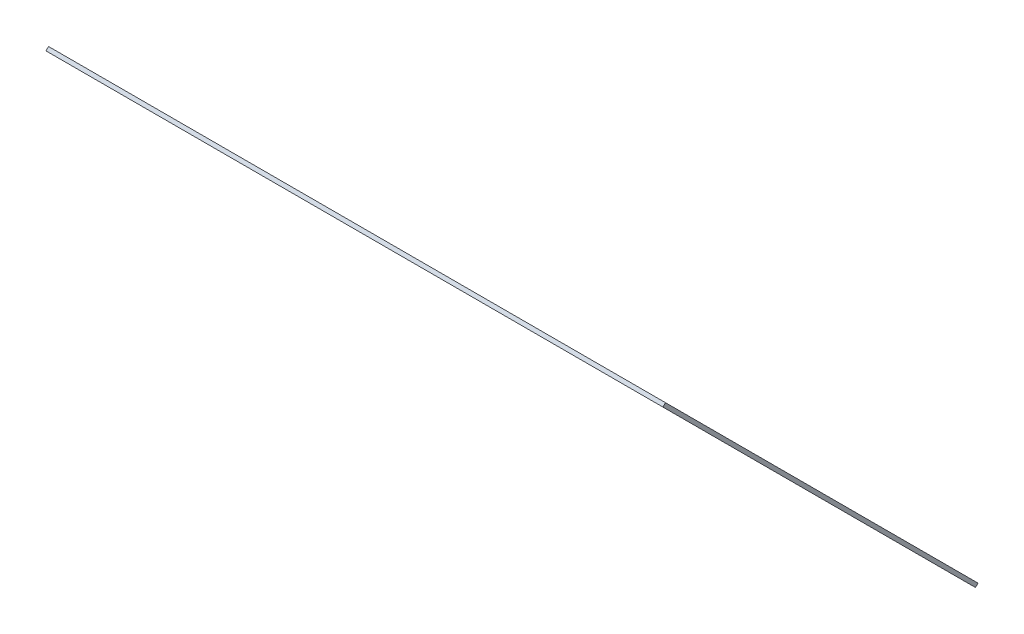
ISO-10303-21;
HEADER;
FILE_DESCRIPTION(('STEP AP214'),'2;1');
FILE_NAME('part.step','',(''),(''),'','','');
FILE_SCHEMA(('AUTOMOTIVE_DESIGN { 1 0 10303 214 1 1 1 1 }'));
ENDSEC;
DATA;
#1=APPLICATION_CONTEXT('core data for automotive mechanical design processes');
#2=APPLICATION_PROTOCOL_DEFINITION('international standard','automotive_design',2000,#1);
#3=PRODUCT_CONTEXT('',#1,'mechanical');
#4=PRODUCT('Part','Part','',(#3));
#5=PRODUCT_RELATED_PRODUCT_CATEGORY('part','',(#4));
#6=PRODUCT_DEFINITION_FORMATION('','',#4);
#7=PRODUCT_DEFINITION_CONTEXT('part definition',#1,'design');
#8=PRODUCT_DEFINITION('design','',#6,#7);
#9=PRODUCT_DEFINITION_SHAPE('','',#8);
#10=(LENGTH_UNIT() NAMED_UNIT(*) SI_UNIT(.MILLI.,.METRE.));
#11=(NAMED_UNIT(*) PLANE_ANGLE_UNIT() SI_UNIT($,.RADIAN.));
#12=(NAMED_UNIT(*) SI_UNIT($,.STERADIAN.) SOLID_ANGLE_UNIT());
#13=UNCERTAINTY_MEASURE_WITH_UNIT(LENGTH_MEASURE(1.E-05),#10,'distance_accuracy_value','');
#14=(GEOMETRIC_REPRESENTATION_CONTEXT(3) GLOBAL_UNCERTAINTY_ASSIGNED_CONTEXT((#13)) GLOBAL_UNIT_ASSIGNED_CONTEXT((#10,
#11,#12)) REPRESENTATION_CONTEXT('',''));
#15=CARTESIAN_POINT('',(0.,0.,0.));
#16=DIRECTION('',(0.,0.,1.));
#17=DIRECTION('',(1.,0.,0.));
#18=AXIS2_PLACEMENT_3D('',#15,#16,#17);
#19=CARTESIAN_POINT('',(1.49999999999996,262.414213562373,35.5857864376269));
#20=DIRECTION('',(1.,0.,0.));
#21=DIRECTION('',(0.,0.,-1.));
#22=AXIS2_PLACEMENT_3D('',#19,#20,#21);
#23=PLANE('',#22);
#24=DIRECTION('',(0.,0.707106781186549,0.707106781186547));
#25=VECTOR('',#24,1.);
#26=CARTESIAN_POINT('',(1.49999999999996,261.,37.));
#27=LINE('',#26,#25);
#28=CARTESIAN_POINT('',(1.49999999999996,261.,37.));
#29=VERTEX_POINT('',#28);
#30=CARTESIAN_POINT('',(1.49999999999996,434.241161390704,210.241161390704));
#31=VERTEX_POINT('',#30);
#32=EDGE_CURVE('E100',#29,#31,#27,.T.);
#33=ORIENTED_EDGE('',*,*,#32,.F.);
#34=DIRECTION('',(0.,-0.707106781186546,0.707106781186549));
#35=VECTOR('',#34,1.);
#36=CARTESIAN_POINT('',(1.49999999999996,262.414213562373,35.5857864376269));
#37=LINE('',#36,#35);
#38=CARTESIAN_POINT('',(1.49999999999996,262.414213562373,35.5857864376269));
#39=VERTEX_POINT('',#38);
#40=EDGE_CURVE('E11',#39,#29,#37,.T.);
#41=ORIENTED_EDGE('',*,*,#40,.F.);
#42=DIRECTION('',(0.,0.707106781186549,0.707106781186547));
#43=VECTOR('',#42,1.);
#44=CARTESIAN_POINT('',(1.49999999999996,262.414213562373,35.5857864376269));
#45=LINE('',#44,#43);
#46=CARTESIAN_POINT('',(1.49999999999996,435.655374953078,208.826947828331));
#47=VERTEX_POINT('',#46);
#48=EDGE_CURVE('E94',#39,#47,#45,.T.);
#49=ORIENTED_EDGE('',*,*,#48,.T.);
#50=DIRECTION('',(0.,-0.707106781186546,0.707106781186549));
#51=VECTOR('',#50,1.);
#52=CARTESIAN_POINT('',(1.49999999999996,435.655374953078,208.826947828331));
#53=LINE('',#52,#51);
#54=EDGE_CURVE('E39',#47,#31,#53,.T.);
#55=ORIENTED_EDGE('',*,*,#54,.T.);
#56=EDGE_LOOP('',(#33,#41,#49,#55));
#57=FACE_BOUND('',#56,.T.);
#58=ADVANCED_FACE('F36',(#57),#23,.T.);
#59=CARTESIAN_POINT('',(-48.5,262.414213562373,35.5857864376269));
#60=DIRECTION('',(0.,-0.707106781186549,-0.707106781186546));
#61=DIRECTION('',(0.,0.707106781186546,-0.707106781186549));
#62=AXIS2_PLACEMENT_3D('',#59,#60,#61);
#63=PLANE('',#62);
#64=DIRECTION('',(1.,0.,0.));
#65=VECTOR('',#64,1.);
#66=CARTESIAN_POINT('',(-48.5,261.,37.));
#67=LINE('',#66,#65);
#68=CARTESIAN_POINT('',(-48.5,261.,37.));
#69=VERTEX_POINT('',#68);
#70=EDGE_CURVE('E96',#69,#29,#67,.T.);
#71=ORIENTED_EDGE('',*,*,#70,.F.);
#72=DIRECTION('',(0.,-0.707106781186546,0.707106781186549));
#73=VECTOR('',#72,1.);
#74=CARTESIAN_POINT('',(-48.5,262.414213562373,35.5857864376269));
#75=LINE('',#74,#73);
#76=CARTESIAN_POINT('',(-48.5,262.414213562373,35.5857864376269));
#77=VERTEX_POINT('',#76);
#78=EDGE_CURVE('E45',#77,#69,#75,.T.);
#79=ORIENTED_EDGE('',*,*,#78,.F.);
#80=DIRECTION('',(1.,0.,0.));
#81=VECTOR('',#80,1.);
#82=CARTESIAN_POINT('',(-48.5,262.414213562373,35.5857864376269));
#83=LINE('',#82,#81);
#84=EDGE_CURVE('E91',#77,#39,#83,.T.);
#85=ORIENTED_EDGE('',*,*,#84,.T.);
#86=ORIENTED_EDGE('',*,*,#40,.T.);
#87=EDGE_LOOP('',(#71,#79,#85,#86));
#88=FACE_BOUND('',#87,.T.);
#89=ADVANCED_FACE('F110',(#88),#63,.T.);
#90=CARTESIAN_POINT('',(-340.479630185585,435.655374953078,208.826947828331));
#91=DIRECTION('',(-0.642787609686535,-0.541675220419706,-0.541675220419704));
#92=DIRECTION('',(0.644400477571777,-0.764688187763657,0.));
#93=AXIS2_PLACEMENT_3D('',#90,#91,#92);
#94=PLANE('',#93);
#95=DIRECTION('',(0.766044443118982,-0.454519477672041,-0.454519477672039));
#96=VECTOR('',#95,1.);
#97=CARTESIAN_POINT('',(-340.479630185585,434.241161390705,210.241161390704));
#98=LINE('',#97,#96);
#99=CARTESIAN_POINT('',(-340.479630185585,434.241161390705,210.241161390704));
#100=VERTEX_POINT('',#99);
#101=EDGE_CURVE('E86',#100,#69,#98,.T.);
#102=ORIENTED_EDGE('',*,*,#101,.F.);
#103=DIRECTION('',(0.,-0.707106781186546,0.707106781186549));
#104=VECTOR('',#103,1.);
#105=CARTESIAN_POINT('',(-340.479630185585,435.655374953078,208.826947828331));
#106=LINE('',#105,#104);
#107=CARTESIAN_POINT('',(-340.479630185585,435.655374953078,208.826947828331));
#108=VERTEX_POINT('',#107);
#109=EDGE_CURVE('E81',#108,#100,#106,.T.);
#110=ORIENTED_EDGE('',*,*,#109,.F.);
#111=DIRECTION('',(0.766044443118982,-0.454519477672041,-0.454519477672039));
#112=VECTOR('',#111,1.);
#113=CARTESIAN_POINT('',(-340.479630185585,435.655374953078,208.826947828331));
#114=LINE('',#113,#112);
#115=EDGE_CURVE('E84',#108,#77,#114,.T.);
#116=ORIENTED_EDGE('',*,*,#115,.T.);
#117=ORIENTED_EDGE('',*,*,#78,.T.);
#118=EDGE_LOOP('',(#102,#110,#116,#117));
#119=FACE_BOUND('',#118,.T.);
#120=ADVANCED_FACE('F83',(#119),#94,.T.);
#121=CARTESIAN_POINT('',(1.49999999999996,435.655374953078,208.826947828331));
#122=DIRECTION('',(0.,0.707106781186549,0.707106781186546));
#123=DIRECTION('',(0.,-0.707106781186546,0.707106781186549));
#124=AXIS2_PLACEMENT_3D('',#121,#122,#123);
#125=PLANE('',#124);
#126=DIRECTION('',(-1.,0.,0.));
#127=VECTOR('',#126,1.);
#128=CARTESIAN_POINT('',(1.49999999999996,434.241161390704,210.241161390704));
#129=LINE('',#128,#127);
#130=EDGE_CURVE('E103',#31,#100,#129,.T.);
#131=ORIENTED_EDGE('',*,*,#130,.F.);
#132=ORIENTED_EDGE('',*,*,#54,.F.);
#133=DIRECTION('',(-1.,0.,0.));
#134=VECTOR('',#133,1.);
#135=CARTESIAN_POINT('',(1.49999999999996,435.655374953078,208.826947828331));
#136=LINE('',#135,#134);
#137=EDGE_CURVE('E90',#47,#108,#136,.T.);
#138=ORIENTED_EDGE('',*,*,#137,.T.);
#139=ORIENTED_EDGE('',*,*,#109,.T.);
#140=EDGE_LOOP('',(#131,#132,#138,#139));
#141=FACE_BOUND('',#140,.T.);
#142=ADVANCED_FACE('F93',(#141),#125,.T.);
#143=CARTESIAN_POINT('',(0.,113.414213562373,-113.414213562373));
#144=DIRECTION('',(0.,-0.707106781186546,0.707106781186549));
#145=DIRECTION('',(0.,-0.707106781186549,-0.707106781186546));
#146=AXIS2_PLACEMENT_3D('',#143,#144,#145);
#147=PLANE('',#146);
#148=ORIENTED_EDGE('',*,*,#48,.F.);
#149=ORIENTED_EDGE('',*,*,#84,.F.);
#150=ORIENTED_EDGE('',*,*,#115,.F.);
#151=ORIENTED_EDGE('',*,*,#137,.F.);
#152=EDGE_LOOP('',(#148,#149,#150,#151));
#153=FACE_BOUND('',#152,.T.);
#154=ADVANCED_FACE('F89',(#153),#147,.F.);
#155=CARTESIAN_POINT('',(0.,112.,-112.));
#156=DIRECTION('',(0.,-0.707106781186546,0.707106781186549));
#157=DIRECTION('',(0.,-0.707106781186549,-0.707106781186546));
#158=AXIS2_PLACEMENT_3D('',#155,#156,#157);
#159=PLANE('',#158);
#160=ORIENTED_EDGE('',*,*,#32,.T.);
#161=ORIENTED_EDGE('',*,*,#130,.T.);
#162=ORIENTED_EDGE('',*,*,#101,.T.);
#163=ORIENTED_EDGE('',*,*,#70,.T.);
#164=EDGE_LOOP('',(#160,#161,#162,#163));
#165=FACE_BOUND('',#164,.T.);
#166=ADVANCED_FACE('F109',(#165),#159,.T.);
#167=CLOSED_SHELL('',(#58,#89,#120,#142,#154,#166));
#168=MANIFOLD_SOLID_BREP('B2',#167);
#169=ADVANCED_BREP_SHAPE_REPRESENTATION('',(#18,#168),#14);
#170=SHAPE_DEFINITION_REPRESENTATION(#9,#169);
ENDSEC;
END-ISO-10303-21;
